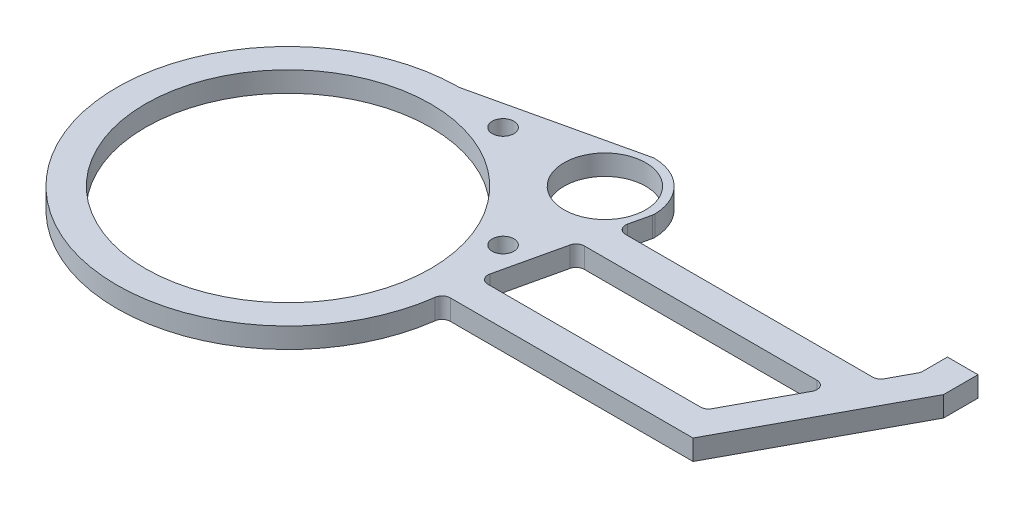
ISO-10303-21;
HEADER;
FILE_DESCRIPTION(('STEP AP214'),'2;1');
FILE_NAME('part.step','',(''),(''),'','','');
FILE_SCHEMA(('AUTOMOTIVE_DESIGN { 1 0 10303 214 1 1 1 1 }'));
ENDSEC;
DATA;
#1=APPLICATION_CONTEXT('core data for automotive mechanical design processes');
#2=APPLICATION_PROTOCOL_DEFINITION('international standard','automotive_design',2000,#1);
#3=PRODUCT_CONTEXT('',#1,'mechanical');
#4=PRODUCT('Part','Part','',(#3));
#5=PRODUCT_RELATED_PRODUCT_CATEGORY('part','',(#4));
#6=PRODUCT_DEFINITION_FORMATION('','',#4);
#7=PRODUCT_DEFINITION_CONTEXT('part definition',#1,'design');
#8=PRODUCT_DEFINITION('design','',#6,#7);
#9=PRODUCT_DEFINITION_SHAPE('','',#8);
#10=(LENGTH_UNIT() NAMED_UNIT(*) SI_UNIT(.MILLI.,.METRE.));
#11=(NAMED_UNIT(*) PLANE_ANGLE_UNIT() SI_UNIT($,.RADIAN.));
#12=(NAMED_UNIT(*) SI_UNIT($,.STERADIAN.) SOLID_ANGLE_UNIT());
#13=UNCERTAINTY_MEASURE_WITH_UNIT(LENGTH_MEASURE(1.E-05),#10,'distance_accuracy_value','');
#14=(GEOMETRIC_REPRESENTATION_CONTEXT(3) GLOBAL_UNCERTAINTY_ASSIGNED_CONTEXT((#13)) GLOBAL_UNIT_ASSIGNED_CONTEXT((#10,
#11,#12)) REPRESENTATION_CONTEXT('',''));
#15=CARTESIAN_POINT('',(0.,0.,0.));
#16=DIRECTION('',(0.,0.,1.));
#17=DIRECTION('',(1.,0.,0.));
#18=AXIS2_PLACEMENT_3D('',#15,#16,#17);
#19=CARTESIAN_POINT('',(53.3781,6.35,0.));
#20=DIRECTION('',(-0.974850171968633,0.,-0.222861262252387));
#21=DIRECTION('',(-0.222861262252387,0.,0.974850171968633));
#22=AXIS2_PLACEMENT_3D('',#19,#20,#21);
#23=PLANE('',#22);
#24=DIRECTION('',(0.222861262252387,0.,-0.974850171968633));
#25=VECTOR('',#24,1.);
#26=CARTESIAN_POINT('',(53.3781,0.,0.));
#27=LINE('',#26,#25);
#28=CARTESIAN_POINT('',(55.1581234537427,0.,-7.78626196608432));
#29=VERTEX_POINT('',#28);
#30=CARTESIAN_POINT('',(59.8034945878766,0.,-28.1062619660843));
#31=VERTEX_POINT('',#30);
#32=EDGE_CURVE('E320',#29,#31,#27,.T.);
#33=ORIENTED_EDGE('',*,*,#32,.T.);
#34=DIRECTION('',(0.,1.,0.));
#35=VECTOR('',#34,1.);
#36=CARTESIAN_POINT('',(59.8034945878766,6.35,-28.1062619660843));
#37=LINE('',#36,#35);
#38=CARTESIAN_POINT('',(59.8034945878766,6.35,-28.1062619660843));
#39=VERTEX_POINT('',#38);
#40=EDGE_CURVE('E371',#31,#39,#37,.T.);
#41=ORIENTED_EDGE('',*,*,#40,.T.);
#42=DIRECTION('',(0.222861262252387,0.,-0.974850171968633));
#43=VECTOR('',#42,1.);
#44=CARTESIAN_POINT('',(53.3781,6.35,0.));
#45=LINE('',#44,#43);
#46=CARTESIAN_POINT('',(55.1581234537427,6.35,-7.78626196608432));
#47=VERTEX_POINT('',#46);
#48=EDGE_CURVE('E308',#47,#39,#45,.T.);
#49=ORIENTED_EDGE('',*,*,#48,.F.);
#50=DIRECTION('',(0.,-1.,0.));
#51=VECTOR('',#50,1.);
#52=CARTESIAN_POINT('',(55.1581234537427,6.35,-7.78626196608431));
#53=LINE('',#52,#51);
#54=EDGE_CURVE('E368',#47,#29,#53,.T.);
#55=ORIENTED_EDGE('',*,*,#54,.T.);
#56=EDGE_LOOP('',(#33,#41,#49,#55));
#57=FACE_BOUND('',#56,.T.);
#58=ADVANCED_FACE('F35',(#57),#23,.F.);
#59=CARTESIAN_POINT('',(0.,6.35,0.));
#60=DIRECTION('',(0.,-1.,0.));
#61=DIRECTION('',(0.,0.,-1.));
#62=AXIS2_PLACEMENT_3D('',#59,#60,#61);
#63=CYLINDRICAL_SURFACE('',#62,53.3781);
#64=CARTESIAN_POINT('',(0.,0.,0.));
#65=DIRECTION('',(0.,1.,0.));
#66=DIRECTION('',(0.,0.,1.));
#67=AXIS2_PLACEMENT_3D('',#64,#65,#66);
#68=CIRCLE('',#67,53.3781);
#69=CARTESIAN_POINT('',(-0.658160349786323,0.,-53.3740422355659));
#70=VERTEX_POINT('',#69);
#71=CARTESIAN_POINT('',(52.9105666564598,0.,7.04936136840211));
#72=VERTEX_POINT('',#71);
#73=EDGE_CURVE('E297',#70,#72,#68,.T.);
#74=ORIENTED_EDGE('',*,*,#73,.T.);
#75=DIRECTION('',(0.,-1.,0.));
#76=VECTOR('',#75,1.);
#77=CARTESIAN_POINT('',(52.9105666564598,6.35,7.0493613684021));
#78=LINE('',#77,#76);
#79=CARTESIAN_POINT('',(52.9105666564598,6.35,7.04936136840211));
#80=VERTEX_POINT('',#79);
#81=EDGE_CURVE('E390',#72,#80,#78,.F.);
#82=ORIENTED_EDGE('',*,*,#81,.T.);
#83=CARTESIAN_POINT('',(0.,6.35,0.));
#84=DIRECTION('',(0.,1.,0.));
#85=DIRECTION('',(0.,0.,1.));
#86=AXIS2_PLACEMENT_3D('',#83,#84,#85);
#87=CIRCLE('',#86,53.3781);
#88=CARTESIAN_POINT('',(-0.658160349786323,6.35,-53.3740422355659));
#89=VERTEX_POINT('',#88);
#90=EDGE_CURVE('E304',#89,#80,#87,.T.);
#91=ORIENTED_EDGE('',*,*,#90,.F.);
#92=DIRECTION('',(0.,-1.,0.));
#93=VECTOR('',#92,1.);
#94=CARTESIAN_POINT('',(-0.658160349786323,6.35,-53.3740422355659));
#95=LINE('',#94,#93);
#96=EDGE_CURVE('E316',#89,#70,#95,.T.);
#97=ORIENTED_EDGE('',*,*,#96,.T.);
#98=EDGE_LOOP('',(#74,#82,#91,#97));
#99=FACE_BOUND('',#98,.T.);
#100=ADVANCED_FACE('F469',(#99),#63,.T.);
#101=CARTESIAN_POINT('',(63.1423550905353,6.35,-42.7112619660843));
#102=VERTEX_POINT('',#101);
#103=CARTESIAN_POINT('',(64.602685842109,6.35,-49.0991091402179));
#104=VERTEX_POINT('',#103);
#105=EDGE_CURVE('E306',#102,#104,#45,.T.);
#106=ORIENTED_EDGE('',*,*,#105,.F.);
#107=DIRECTION('',(0.,-1.,0.));
#108=VECTOR('',#107,1.);
#109=CARTESIAN_POINT('',(63.1423550905353,6.35,-42.7112619660843));
#110=LINE('',#109,#108);
#111=CARTESIAN_POINT('',(63.1423550905353,0.,-42.7112619660843));
#112=VERTEX_POINT('',#111);
#113=EDGE_CURVE('E339',#102,#112,#110,.T.);
#114=ORIENTED_EDGE('',*,*,#113,.T.);
#115=CARTESIAN_POINT('',(64.602685842109,0.,-49.0991091402179));
#116=VERTEX_POINT('',#115);
#117=EDGE_CURVE('E319',#112,#116,#27,.T.);
#118=ORIENTED_EDGE('',*,*,#117,.T.);
#119=DIRECTION('',(0.,-1.,0.));
#120=VECTOR('',#119,1.);
#121=CARTESIAN_POINT('',(64.602685842109,6.35,-49.0991091402179));
#122=LINE('',#121,#120);
#123=EDGE_CURVE('E337',#116,#104,#122,.F.);
#124=ORIENTED_EDGE('',*,*,#123,.T.);
#125=EDGE_LOOP('',(#106,#114,#118,#124));
#126=FACE_BOUND('',#125,.T.);
#127=ADVANCED_FACE('F471',(#126),#23,.F.);
#128=CARTESIAN_POINT('',(49.3914086658803,6.35,-49.3914086658803));
#129=DIRECTION('',(0.,-1.,0.));
#130=DIRECTION('',(0.,0.,-1.));
#131=AXIS2_PLACEMENT_3D('',#128,#129,#130);
#132=CYLINDRICAL_SURFACE('',#131,15.2781);
#133=CARTESIAN_POINT('',(49.3914086658803,0.,-49.3914086658803));
#134=DIRECTION('',(0.,1.,0.));
#135=DIRECTION('',(0.,0.,-1.));
#136=AXIS2_PLACEMENT_3D('',#133,#134,#135);
#137=CIRCLE('',#136,15.2781);
#138=CARTESIAN_POINT('',(64.6659797132705,0.,-49.7197665928911));
#139=VERTEX_POINT('',#138);
#140=CARTESIAN_POINT('',(49.7197665928911,0.,-64.6659797132705));
#141=VERTEX_POINT('',#140);
#142=EDGE_CURVE('E323',#139,#141,#137,.T.);
#143=ORIENTED_EDGE('',*,*,#142,.T.);
#144=DIRECTION('',(0.,-1.,0.));
#145=VECTOR('',#144,1.);
#146=CARTESIAN_POINT('',(49.7197665928911,6.35,-64.6659797132705));
#147=LINE('',#146,#145);
#148=CARTESIAN_POINT('',(49.7197665928911,6.35,-64.6659797132705));
#149=VERTEX_POINT('',#148);
#150=EDGE_CURVE('E384',#141,#149,#147,.F.);
#151=ORIENTED_EDGE('',*,*,#150,.T.);
#152=CARTESIAN_POINT('',(49.3914086658803,6.35,-49.3914086658803));
#153=DIRECTION('',(0.,1.,0.));
#154=DIRECTION('',(0.,0.,-1.));
#155=AXIS2_PLACEMENT_3D('',#152,#153,#154);
#156=CIRCLE('',#155,15.2781);
#157=CARTESIAN_POINT('',(64.6659797132705,6.35,-49.7197665928911));
#158=VERTEX_POINT('',#157);
#159=EDGE_CURVE('E311',#158,#149,#156,.T.);
#160=ORIENTED_EDGE('',*,*,#159,.F.);
#161=DIRECTION('',(0.,-1.,0.));
#162=VECTOR('',#161,1.);
#163=CARTESIAN_POINT('',(64.6659797132705,6.35,-49.7197665928911));
#164=LINE('',#163,#162);
#165=EDGE_CURVE('E381',#158,#139,#164,.T.);
#166=ORIENTED_EDGE('',*,*,#165,.T.);
#167=EDGE_LOOP('',(#143,#151,#160,#166));
#168=FACE_BOUND('',#167,.T.);
#169=ADVANCED_FACE('F479',(#168),#132,.T.);
#170=CARTESIAN_POINT('',(0.,6.35,-53.3781));
#171=DIRECTION('',(0.222861262252387,0.,0.974850171968633));
#172=DIRECTION('',(0.974850171968633,0.,-0.222861262252387));
#173=AXIS2_PLACEMENT_3D('',#170,#171,#172);
#174=PLANE('',#173);
#175=DIRECTION('',(-0.974850171968633,0.,0.222861262252387));
#176=VECTOR('',#175,1.);
#177=CARTESIAN_POINT('',(0.,6.35,-53.3781));
#178=LINE('',#177,#176);
#179=CARTESIAN_POINT('',(49.0991091402179,6.35,-64.602685842109));
#180=VERTEX_POINT('',#179);
#181=CARTESIAN_POINT('',(0.678712168991673,6.35,-53.5332609211722));
#182=VERTEX_POINT('',#181);
#183=EDGE_CURVE('E314',#180,#182,#178,.T.);
#184=ORIENTED_EDGE('',*,*,#183,.F.);
#185=DIRECTION('',(0.,-1.,0.));
#186=VECTOR('',#185,1.);
#187=CARTESIAN_POINT('',(49.0991091402179,6.35,-64.602685842109));
#188=LINE('',#187,#186);
#189=CARTESIAN_POINT('',(49.0991091402179,0.,-64.602685842109));
#190=VERTEX_POINT('',#189);
#191=EDGE_CURVE('E374',#180,#190,#188,.T.);
#192=ORIENTED_EDGE('',*,*,#191,.T.);
#193=DIRECTION('',(-0.974850171968633,0.,0.222861262252387));
#194=VECTOR('',#193,1.);
#195=CARTESIAN_POINT('',(0.,0.,-53.3781));
#196=LINE('',#195,#194);
#197=CARTESIAN_POINT('',(0.678712168991673,0.,-53.5332609211722));
#198=VERTEX_POINT('',#197);
#199=EDGE_CURVE('E307',#190,#198,#196,.T.);
#200=ORIENTED_EDGE('',*,*,#199,.T.);
#201=DIRECTION('',(0.,1.,0.));
#202=VECTOR('',#201,1.);
#203=CARTESIAN_POINT('',(0.678712168991673,6.35,-53.5332609211722));
#204=LINE('',#203,#202);
#205=EDGE_CURVE('E329',#198,#182,#204,.T.);
#206=ORIENTED_EDGE('',*,*,#205,.T.);
#207=EDGE_LOOP('',(#184,#192,#200,#206));
#208=FACE_BOUND('',#207,.T.);
#209=ADVANCED_FACE('F484',(#208),#174,.F.);
#210=CARTESIAN_POINT('',(0.,6.35,0.));
#211=DIRECTION('',(0.,1.,0.));
#212=DIRECTION('',(0.,0.,1.));
#213=AXIS2_PLACEMENT_3D('',#210,#211,#212);
#214=PLANE('',#213);
#215=CARTESIAN_POINT('',(49.3914086658803,6.35,-17.6414086658803));
#216=DIRECTION('',(0.,1.,0.));
#217=DIRECTION('',(0.,0.,1.));
#218=AXIS2_PLACEMENT_3D('',#215,#216,#217);
#219=CIRCLE('',#218,3.37819999999999);
#220=CARTESIAN_POINT('',(49.3914086658803,6.35,-14.2632086658804));
#221=VERTEX_POINT('',#220);
#222=EDGE_CURVE('E831',#221,#221,#219,.T.);
#223=ORIENTED_EDGE('',*,*,#222,.F.);
#224=EDGE_LOOP('',(#223));
#225=FACE_BOUND('',#224,.T.);
#226=CARTESIAN_POINT('',(17.6414086658803,6.35,-49.3914086658804));
#227=DIRECTION('',(0.,1.,0.));
#228=DIRECTION('',(0.,0.,1.));
#229=AXIS2_PLACEMENT_3D('',#226,#227,#228);
#230=CIRCLE('',#229,3.3782);
#231=CARTESIAN_POINT('',(17.6414086658803,6.35,-46.0132086658804));
#232=VERTEX_POINT('',#231);
#233=EDGE_CURVE('E841',#232,#232,#230,.T.);
#234=ORIENTED_EDGE('',*,*,#233,.F.);
#235=EDGE_LOOP('',(#234));
#236=FACE_BOUND('',#235,.T.);
#237=CARTESIAN_POINT('',(49.3914086658803,6.35,-49.3914086658803));
#238=DIRECTION('',(0.,1.,0.));
#239=DIRECTION('',(0.,0.,1.));
#240=AXIS2_PLACEMENT_3D('',#237,#238,#239);
#241=CIRCLE('',#240,12.7254);
#242=CARTESIAN_POINT('',(49.3914086658803,6.35,-36.6660086658803));
#243=VERTEX_POINT('',#242);
#244=EDGE_CURVE('E217',#243,#243,#241,.T.);
#245=ORIENTED_EDGE('',*,*,#244,.F.);
#246=EDGE_LOOP('',(#245));
#247=FACE_BOUND('',#246,.T.);
#248=CARTESIAN_POINT('',(0.,6.35,0.));
#249=DIRECTION('',(0.,1.,0.));
#250=DIRECTION('',(0.,0.,1.));
#251=AXIS2_PLACEMENT_3D('',#248,#249,#250);
#252=CIRCLE('',#251,44.4754);
#253=CARTESIAN_POINT('',(0.,6.35,44.4754));
#254=VERTEX_POINT('',#253);
#255=EDGE_CURVE('E229',#254,#254,#252,.T.);
#256=ORIENTED_EDGE('',*,*,#255,.F.);
#257=EDGE_LOOP('',(#256));
#258=FACE_BOUND('',#257,.T.);
#259=ORIENTED_EDGE('',*,*,#159,.T.);
#260=CARTESIAN_POINT('',(49.665176746339,6.35,-62.1265664053087));
#261=DIRECTION('',(0.,1.,0.));
#262=DIRECTION('',(0.,0.,1.));
#263=AXIS2_PLACEMENT_3D('',#260,#261,#262);
#264=CIRCLE('',#263,2.54);
#265=EDGE_CURVE('E388',#149,#180,#264,.T.);
#266=ORIENTED_EDGE('',*,*,#265,.T.);
#267=ORIENTED_EDGE('',*,*,#183,.T.);
#268=CARTESIAN_POINT('',(-0.736456846310987,6.35,-59.723559513173));
#269=DIRECTION('',(0.,1.,0.));
#270=DIRECTION('',(0.,0.,1.));
#271=AXIS2_PLACEMENT_3D('',#268,#269,#270);
#272=CIRCLE('',#271,6.35);
#273=EDGE_CURVE('E335',#182,#89,#272,.F.);
#274=ORIENTED_EDGE('',*,*,#273,.T.);
#275=ORIENTED_EDGE('',*,*,#90,.T.);
#276=CARTESIAN_POINT('',(55.4283190550542,6.35,7.38480564003675));
#277=DIRECTION('',(0.,1.,0.));
#278=DIRECTION('',(0.,0.,1.));
#279=AXIS2_PLACEMENT_3D('',#276,#277,#278);
#280=CIRCLE('',#279,2.54);
#281=CARTESIAN_POINT('',(55.4283190550542,6.35,4.84480564003675));
#282=VERTEX_POINT('',#281);
#283=EDGE_CURVE('E50',#80,#282,#280,.F.);
#284=ORIENTED_EDGE('',*,*,#283,.T.);
#285=DIRECTION('',(1.,0.,0.));
#286=VECTOR('',#285,1.);
#287=CARTESIAN_POINT('',(52.07,6.35,4.84480564003675));
#288=LINE('',#287,#286);
#289=CARTESIAN_POINT('',(131.116478856658,6.35,4.84480564003675));
#290=VERTEX_POINT('',#289);
#291=EDGE_CURVE('E234',#282,#290,#288,.T.);
#292=ORIENTED_EDGE('',*,*,#291,.T.);
#293=DIRECTION('',(0.473591355647654,0.,-0.880744700725367));
#294=VECTOR('',#293,1.);
#295=CARTESIAN_POINT('',(131.116478856658,6.35,4.84480564003675));
#296=LINE('',#295,#294);
#297=CARTESIAN_POINT('',(158.4325,6.35,-45.9551943599632));
#298=VERTEX_POINT('',#297);
#299=EDGE_CURVE('E269',#290,#298,#296,.T.);
#300=ORIENTED_EDGE('',*,*,#299,.T.);
#301=DIRECTION('',(0.,0.,-1.));
#302=VECTOR('',#301,1.);
#303=CARTESIAN_POINT('',(158.4325,6.35,-45.9551943599632));
#304=LINE('',#303,#302);
#305=CARTESIAN_POINT('',(158.4325,6.35,-56.6794420996495));
#306=VERTEX_POINT('',#305);
#307=EDGE_CURVE('E272',#298,#306,#304,.T.);
#308=ORIENTED_EDGE('',*,*,#307,.T.);
#309=DIRECTION('',(-1.,0.,0.));
#310=VECTOR('',#309,1.);
#311=CARTESIAN_POINT('',(158.4325,6.35,-56.6794420996495));
#312=LINE('',#311,#310);
#313=CARTESIAN_POINT('',(148.9075,6.35,-56.6794420996495));
#314=VERTEX_POINT('',#313);
#315=EDGE_CURVE('E275',#306,#314,#312,.T.);
#316=ORIENTED_EDGE('',*,*,#315,.T.);
#317=DIRECTION('',(0.,0.,1.));
#318=VECTOR('',#317,1.);
#319=CARTESIAN_POINT('',(148.9075,6.35,-48.3536898393359));
#320=LINE('',#319,#318);
#321=CARTESIAN_POINT('',(148.9075,6.35,-48.9932886338353));
#322=VERTEX_POINT('',#321);
#323=EDGE_CURVE('E278',#314,#322,#320,.T.);
#324=ORIENTED_EDGE('',*,*,#323,.T.);
#325=CARTESIAN_POINT('',(146.3675,6.35,-48.9932886338353));
#326=DIRECTION('',(0.,1.,0.));
#327=DIRECTION('',(0.,0.,1.));
#328=AXIS2_PLACEMENT_3D('',#325,#326,#327);
#329=CIRCLE('',#328,2.54);
#330=CARTESIAN_POINT('',(148.604591539842,6.35,-47.7903665904903));
#331=VERTEX_POINT('',#330);
#332=EDGE_CURVE('E402',#322,#331,#329,.F.);
#333=ORIENTED_EDGE('',*,*,#332,.T.);
#334=DIRECTION('',(-0.473591355647655,0.,0.880744700725367));
#335=VECTOR('',#334,1.);
#336=CARTESIAN_POINT('',(144.20328567939,6.35,-39.6051943599632));
#337=LINE('',#336,#335);
#338=CARTESIAN_POINT('',(144.922255162349,6.35,-40.9422723166182));
#339=VERTEX_POINT('',#338);
#340=EDGE_CURVE('E281',#331,#339,#337,.T.);
#341=ORIENTED_EDGE('',*,*,#340,.T.);
#342=CARTESIAN_POINT('',(142.685163622506,6.35,-42.1451943599632));
#343=DIRECTION('',(0.,1.,0.));
#344=DIRECTION('',(0.,0.,1.));
#345=AXIS2_PLACEMENT_3D('',#342,#343,#344);
#346=CIRCLE('',#345,2.54);
#347=CARTESIAN_POINT('',(142.685163622506,6.35,-39.6051943599632));
#348=VERTEX_POINT('',#347);
#349=EDGE_CURVE('E398',#339,#348,#346,.F.);
#350=ORIENTED_EDGE('',*,*,#349,.T.);
#351=DIRECTION('',(-1.,0.,0.));
#352=VECTOR('',#351,1.);
#353=CARTESIAN_POINT('',(52.07,6.35,-39.6051943599632));
#354=LINE('',#353,#352);
#355=CARTESIAN_POINT('',(65.6184745273356,6.35,-39.6051943599632));
#356=VERTEX_POINT('',#355);
#357=EDGE_CURVE('E284',#348,#356,#354,.T.);
#358=ORIENTED_EDGE('',*,*,#357,.T.);
#359=CARTESIAN_POINT('',(65.6184745273356,6.35,-42.1451943599632));
#360=DIRECTION('',(0.,1.,0.));
#361=DIRECTION('',(0.,0.,1.));
#362=AXIS2_PLACEMENT_3D('',#359,#360,#361);
#363=CIRCLE('',#362,2.54);
#364=EDGE_CURVE('E396',#356,#102,#363,.F.);
#365=ORIENTED_EDGE('',*,*,#364,.T.);
#366=ORIENTED_EDGE('',*,*,#105,.T.);
#367=CARTESIAN_POINT('',(62.1265664053087,6.35,-49.665176746339));
#368=DIRECTION('',(0.,1.,0.));
#369=DIRECTION('',(0.,0.,1.));
#370=AXIS2_PLACEMENT_3D('',#367,#368,#369);
#371=CIRCLE('',#370,2.54);
#372=EDGE_CURVE('E386',#104,#158,#371,.T.);
#373=ORIENTED_EDGE('',*,*,#372,.T.);
#374=EDGE_LOOP('',(#259,#266,#267,#274,#275,#284,#292,#300,#308,#316,#324,#333,#341,#350,#358,
#365,#366,#373));
#375=FACE_BOUND('',#374,.T.);
#376=DIRECTION('',(-1.,0.,0.));
#377=VECTOR('',#376,1.);
#378=CARTESIAN_POINT('',(52.07,6.35,-4.68019435996325));
#379=LINE('',#378,#377);
#380=CARTESIAN_POINT('',(123.905399086458,6.35,-4.68019435996325));
#381=VERTEX_POINT('',#380);
#382=CARTESIAN_POINT('',(57.6342428905431,6.35,-4.68019435996325));
#383=VERTEX_POINT('',#382);
#384=EDGE_CURVE('E240',#381,#383,#379,.T.);
#385=ORIENTED_EDGE('',*,*,#384,.T.);
#386=CARTESIAN_POINT('',(57.6342428905431,6.35,-7.22019435996325));
#387=DIRECTION('',(0.,1.,0.));
#388=DIRECTION('',(0.,0.,1.));
#389=AXIS2_PLACEMENT_3D('',#386,#387,#388);
#390=CIRCLE('',#389,2.54);
#391=EDGE_CURVE('E11',#383,#47,#390,.F.);
#392=ORIENTED_EDGE('',*,*,#391,.T.);
#393=ORIENTED_EDGE('',*,*,#48,.T.);
#394=CARTESIAN_POINT('',(62.2796140246769,6.35,-27.5401943599632));
#395=DIRECTION('',(0.,1.,0.));
#396=DIRECTION('',(0.,0.,1.));
#397=AXIS2_PLACEMENT_3D('',#394,#395,#396);
#398=CIRCLE('',#397,2.54);
#399=CARTESIAN_POINT('',(62.2796140246769,6.35,-30.0801943599632));
#400=VERTEX_POINT('',#399);
#401=EDGE_CURVE('E414',#39,#400,#398,.F.);
#402=ORIENTED_EDGE('',*,*,#401,.T.);
#403=DIRECTION('',(1.,0.,0.));
#404=VECTOR('',#403,1.);
#405=CARTESIAN_POINT('',(52.07,6.35,-30.0801943599632));
#406=LINE('',#405,#404);
#407=CARTESIAN_POINT('',(134.831807543795,6.35,-30.0801943599632));
#408=VERTEX_POINT('',#407);
#409=EDGE_CURVE('E287',#400,#408,#406,.T.);
#410=ORIENTED_EDGE('',*,*,#409,.T.);
#411=CARTESIAN_POINT('',(134.831807543795,6.35,-27.5401943599632));
#412=DIRECTION('',(0.,1.,0.));
#413=DIRECTION('',(0.,0.,1.));
#414=AXIS2_PLACEMENT_3D('',#411,#412,#413);
#415=CIRCLE('',#414,2.54);
#416=CARTESIAN_POINT('',(137.068899083638,6.35,-26.3372723166182));
#417=VERTEX_POINT('',#416);
#418=EDGE_CURVE('E406',#408,#417,#415,.F.);
#419=ORIENTED_EDGE('',*,*,#418,.T.);
#420=DIRECTION('',(-0.473591355647654,0.,0.880744700725367));
#421=VECTOR('',#420,1.);
#422=CARTESIAN_POINT('',(125.423521143342,6.35,-4.68019435996325));
#423=LINE('',#422,#421);
#424=CARTESIAN_POINT('',(126.142490626301,6.35,-6.01727231661821));
#425=VERTEX_POINT('',#424);
#426=EDGE_CURVE('E290',#417,#425,#423,.T.);
#427=ORIENTED_EDGE('',*,*,#426,.T.);
#428=CARTESIAN_POINT('',(123.905399086458,6.35,-7.22019435996325));
#429=DIRECTION('',(0.,1.,0.));
#430=DIRECTION('',(0.,0.,1.));
#431=AXIS2_PLACEMENT_3D('',#428,#429,#430);
#432=CIRCLE('',#431,2.54);
#433=EDGE_CURVE('E410',#425,#381,#432,.F.);
#434=ORIENTED_EDGE('',*,*,#433,.T.);
#435=EDGE_LOOP('',(#385,#392,#393,#402,#410,#419,#427,#434));
#436=FACE_BOUND('',#435,.T.);
#437=ADVANCED_FACE('F436',(#225,#236,#247,#258,#375,#436),#214,.T.);
#438=CARTESIAN_POINT('',(0.,0.,0.));
#439=DIRECTION('',(0.,1.,0.));
#440=DIRECTION('',(0.,0.,1.));
#441=AXIS2_PLACEMENT_3D('',#438,#439,#440);
#442=PLANE('',#441);
#443=CARTESIAN_POINT('',(49.3914086658803,0.,-17.6414086658803));
#444=DIRECTION('',(0.,-1.,0.));
#445=DIRECTION('',(0.,0.,-1.));
#446=AXIS2_PLACEMENT_3D('',#443,#444,#445);
#447=CIRCLE('',#446,3.3782);
#448=CARTESIAN_POINT('',(49.3914086658803,0.,-21.0196086658803));
#449=VERTEX_POINT('',#448);
#450=EDGE_CURVE('E834',#449,#449,#447,.T.);
#451=ORIENTED_EDGE('',*,*,#450,.F.);
#452=EDGE_LOOP('',(#451));
#453=FACE_BOUND('',#452,.T.);
#454=CARTESIAN_POINT('',(17.6414086658803,0.,-49.3914086658804));
#455=DIRECTION('',(0.,-1.,0.));
#456=DIRECTION('',(0.,0.,-1.));
#457=AXIS2_PLACEMENT_3D('',#454,#455,#456);
#458=CIRCLE('',#457,3.3782);
#459=CARTESIAN_POINT('',(17.6414086658803,0.,-52.7696086658804));
#460=VERTEX_POINT('',#459);
#461=EDGE_CURVE('E836',#460,#460,#458,.T.);
#462=ORIENTED_EDGE('',*,*,#461,.F.);
#463=EDGE_LOOP('',(#462));
#464=FACE_BOUND('',#463,.T.);
#465=CARTESIAN_POINT('',(49.3914086658803,0.,-49.3914086658803));
#466=DIRECTION('',(0.,1.,0.));
#467=DIRECTION('',(0.,0.,1.));
#468=AXIS2_PLACEMENT_3D('',#465,#466,#467);
#469=CIRCLE('',#468,12.7254);
#470=CARTESIAN_POINT('',(49.3914086658803,0.,-36.6660086658803));
#471=VERTEX_POINT('',#470);
#472=EDGE_CURVE('E221',#471,#471,#469,.T.);
#473=ORIENTED_EDGE('',*,*,#472,.T.);
#474=EDGE_LOOP('',(#473));
#475=FACE_BOUND('',#474,.T.);
#476=CARTESIAN_POINT('',(0.,0.,0.));
#477=DIRECTION('',(0.,1.,0.));
#478=DIRECTION('',(0.,0.,1.));
#479=AXIS2_PLACEMENT_3D('',#476,#477,#478);
#480=CIRCLE('',#479,44.4754);
#481=CARTESIAN_POINT('',(0.,0.,44.4754));
#482=VERTEX_POINT('',#481);
#483=EDGE_CURVE('E231',#482,#482,#480,.T.);
#484=ORIENTED_EDGE('',*,*,#483,.T.);
#485=EDGE_LOOP('',(#484));
#486=FACE_BOUND('',#485,.T.);
#487=ORIENTED_EDGE('',*,*,#199,.F.);
#488=CARTESIAN_POINT('',(49.665176746339,0.,-62.1265664053087));
#489=DIRECTION('',(0.,1.,0.));
#490=DIRECTION('',(0.,0.,1.));
#491=AXIS2_PLACEMENT_3D('',#488,#489,#490);
#492=CIRCLE('',#491,2.54);
#493=EDGE_CURVE('E379',#190,#141,#492,.F.);
#494=ORIENTED_EDGE('',*,*,#493,.T.);
#495=ORIENTED_EDGE('',*,*,#142,.F.);
#496=CARTESIAN_POINT('',(62.1265664053087,0.,-49.665176746339));
#497=DIRECTION('',(0.,1.,0.));
#498=DIRECTION('',(0.,0.,1.));
#499=AXIS2_PLACEMENT_3D('',#496,#497,#498);
#500=CIRCLE('',#499,2.54);
#501=EDGE_CURVE('E377',#139,#116,#500,.F.);
#502=ORIENTED_EDGE('',*,*,#501,.T.);
#503=ORIENTED_EDGE('',*,*,#117,.F.);
#504=CARTESIAN_POINT('',(65.6184745273356,0.,-42.1451943599632));
#505=DIRECTION('',(0.,1.,0.));
#506=DIRECTION('',(0.,0.,1.));
#507=AXIS2_PLACEMENT_3D('',#504,#505,#506);
#508=CIRCLE('',#507,2.54);
#509=CARTESIAN_POINT('',(65.6184745273356,0.,-39.6051943599632));
#510=VERTEX_POINT('',#509);
#511=EDGE_CURVE('E394',#112,#510,#508,.T.);
#512=ORIENTED_EDGE('',*,*,#511,.T.);
#513=DIRECTION('',(-1.,0.,0.));
#514=VECTOR('',#513,1.);
#515=CARTESIAN_POINT('',(52.07,0.,-39.6051943599632));
#516=LINE('',#515,#514);
#517=CARTESIAN_POINT('',(142.685163622506,0.,-39.6051943599632));
#518=VERTEX_POINT('',#517);
#519=EDGE_CURVE('E255',#518,#510,#516,.T.);
#520=ORIENTED_EDGE('',*,*,#519,.F.);
#521=CARTESIAN_POINT('',(142.685163622506,0.,-42.1451943599632));
#522=DIRECTION('',(0.,1.,0.));
#523=DIRECTION('',(0.,0.,1.));
#524=AXIS2_PLACEMENT_3D('',#521,#522,#523);
#525=CIRCLE('',#524,2.54);
#526=CARTESIAN_POINT('',(144.922255162349,0.,-40.9422723166182));
#527=VERTEX_POINT('',#526);
#528=EDGE_CURVE('E400',#518,#527,#525,.T.);
#529=ORIENTED_EDGE('',*,*,#528,.T.);
#530=DIRECTION('',(-0.473591355647655,0.,0.880744700725367));
#531=VECTOR('',#530,1.);
#532=CARTESIAN_POINT('',(144.20328567939,0.,-39.6051943599632));
#533=LINE('',#532,#531);
#534=CARTESIAN_POINT('',(148.604591539842,0.,-47.7903665904903));
#535=VERTEX_POINT('',#534);
#536=EDGE_CURVE('E252',#535,#527,#533,.T.);
#537=ORIENTED_EDGE('',*,*,#536,.F.);
#538=CARTESIAN_POINT('',(146.3675,0.,-48.9932886338353));
#539=DIRECTION('',(0.,1.,0.));
#540=DIRECTION('',(0.,0.,1.));
#541=AXIS2_PLACEMENT_3D('',#538,#539,#540);
#542=CIRCLE('',#541,2.54);
#543=CARTESIAN_POINT('',(148.9075,0.,-48.9932886338353));
#544=VERTEX_POINT('',#543);
#545=EDGE_CURVE('E404',#535,#544,#542,.T.);
#546=ORIENTED_EDGE('',*,*,#545,.T.);
#547=DIRECTION('',(0.,0.,1.));
#548=VECTOR('',#547,1.);
#549=CARTESIAN_POINT('',(148.9075,0.,-48.3536898393359));
#550=LINE('',#549,#548);
#551=CARTESIAN_POINT('',(148.9075,0.,-56.6794420996495));
#552=VERTEX_POINT('',#551);
#553=EDGE_CURVE('E249',#552,#544,#550,.T.);
#554=ORIENTED_EDGE('',*,*,#553,.F.);
#555=DIRECTION('',(-1.,0.,0.));
#556=VECTOR('',#555,1.);
#557=CARTESIAN_POINT('',(158.4325,0.,-56.6794420996495));
#558=LINE('',#557,#556);
#559=CARTESIAN_POINT('',(158.4325,0.,-56.6794420996495));
#560=VERTEX_POINT('',#559);
#561=EDGE_CURVE('E246',#560,#552,#558,.T.);
#562=ORIENTED_EDGE('',*,*,#561,.F.);
#563=DIRECTION('',(0.,0.,-1.));
#564=VECTOR('',#563,1.);
#565=CARTESIAN_POINT('',(158.4325,0.,-45.9551943599632));
#566=LINE('',#565,#564);
#567=CARTESIAN_POINT('',(158.4325,0.,-45.9551943599632));
#568=VERTEX_POINT('',#567);
#569=EDGE_CURVE('E243',#568,#560,#566,.T.);
#570=ORIENTED_EDGE('',*,*,#569,.F.);
#571=DIRECTION('',(0.473591355647654,0.,-0.880744700725367));
#572=VECTOR('',#571,1.);
#573=CARTESIAN_POINT('',(131.116478856658,0.,4.84480564003675));
#574=LINE('',#573,#572);
#575=CARTESIAN_POINT('',(131.116478856658,0.,4.84480564003675));
#576=VERTEX_POINT('',#575);
#577=EDGE_CURVE('E239',#576,#568,#574,.T.);
#578=ORIENTED_EDGE('',*,*,#577,.F.);
#579=DIRECTION('',(1.,0.,0.));
#580=VECTOR('',#579,1.);
#581=CARTESIAN_POINT('',(52.07,0.,4.84480564003675));
#582=LINE('',#581,#580);
#583=CARTESIAN_POINT('',(55.4283190550542,0.,4.84480564003675));
#584=VERTEX_POINT('',#583);
#585=EDGE_CURVE('E237',#584,#576,#582,.T.);
#586=ORIENTED_EDGE('',*,*,#585,.F.);
#587=CARTESIAN_POINT('',(55.4283190550542,0.,7.38480564003675));
#588=DIRECTION('',(0.,1.,0.));
#589=DIRECTION('',(0.,0.,1.));
#590=AXIS2_PLACEMENT_3D('',#587,#588,#589);
#591=CIRCLE('',#590,2.54);
#592=EDGE_CURVE('E419',#584,#72,#591,.T.);
#593=ORIENTED_EDGE('',*,*,#592,.T.);
#594=ORIENTED_EDGE('',*,*,#73,.F.);
#595=CARTESIAN_POINT('',(-0.736456846310987,0.,-59.723559513173));
#596=DIRECTION('',(0.,1.,0.));
#597=DIRECTION('',(0.,0.,1.));
#598=AXIS2_PLACEMENT_3D('',#595,#596,#597);
#599=CIRCLE('',#598,6.35);
#600=EDGE_CURVE('E332',#70,#198,#599,.T.);
#601=ORIENTED_EDGE('',*,*,#600,.T.);
#602=EDGE_LOOP('',(#487,#494,#495,#502,#503,#512,#520,#529,#537,#546,#554,#562,#570,#578,#586,
#593,#594,#601));
#603=FACE_BOUND('',#602,.T.);
#604=DIRECTION('',(1.,0.,0.));
#605=VECTOR('',#604,1.);
#606=CARTESIAN_POINT('',(52.07,0.,-30.0801943599632));
#607=LINE('',#606,#605);
#608=CARTESIAN_POINT('',(62.2796140246769,0.,-30.0801943599632));
#609=VERTEX_POINT('',#608);
#610=CARTESIAN_POINT('',(134.831807543795,0.,-30.0801943599632));
#611=VERTEX_POINT('',#610);
#612=EDGE_CURVE('E258',#609,#611,#607,.T.);
#613=ORIENTED_EDGE('',*,*,#612,.F.);
#614=CARTESIAN_POINT('',(62.2796140246769,0.,-27.5401943599632));
#615=DIRECTION('',(0.,1.,0.));
#616=DIRECTION('',(0.,0.,1.));
#617=AXIS2_PLACEMENT_3D('',#614,#615,#616);
#618=CIRCLE('',#617,2.54);
#619=EDGE_CURVE('E416',#609,#31,#618,.T.);
#620=ORIENTED_EDGE('',*,*,#619,.T.);
#621=ORIENTED_EDGE('',*,*,#32,.F.);
#622=CARTESIAN_POINT('',(57.6342428905431,0.,-7.22019435996325));
#623=DIRECTION('',(0.,1.,0.));
#624=DIRECTION('',(0.,0.,1.));
#625=AXIS2_PLACEMENT_3D('',#622,#623,#624);
#626=CIRCLE('',#625,2.54);
#627=CARTESIAN_POINT('',(57.6342428905431,0.,-4.68019435996325));
#628=VERTEX_POINT('',#627);
#629=EDGE_CURVE('E43',#29,#628,#626,.T.);
#630=ORIENTED_EDGE('',*,*,#629,.T.);
#631=DIRECTION('',(-1.,0.,0.));
#632=VECTOR('',#631,1.);
#633=CARTESIAN_POINT('',(52.07,0.,-4.68019435996325));
#634=LINE('',#633,#632);
#635=CARTESIAN_POINT('',(123.905399086458,0.,-4.68019435996325));
#636=VERTEX_POINT('',#635);
#637=EDGE_CURVE('E264',#636,#628,#634,.T.);
#638=ORIENTED_EDGE('',*,*,#637,.F.);
#639=CARTESIAN_POINT('',(123.905399086458,0.,-7.22019435996325));
#640=DIRECTION('',(0.,1.,0.));
#641=DIRECTION('',(0.,0.,1.));
#642=AXIS2_PLACEMENT_3D('',#639,#640,#641);
#643=CIRCLE('',#642,2.54);
#644=CARTESIAN_POINT('',(126.142490626301,0.,-6.01727231661821));
#645=VERTEX_POINT('',#644);
#646=EDGE_CURVE('E412',#636,#645,#643,.T.);
#647=ORIENTED_EDGE('',*,*,#646,.T.);
#648=DIRECTION('',(-0.473591355647654,0.,0.880744700725367));
#649=VECTOR('',#648,1.);
#650=CARTESIAN_POINT('',(125.423521143342,0.,-4.68019435996325));
#651=LINE('',#650,#649);
#652=CARTESIAN_POINT('',(137.068899083638,0.,-26.3372723166182));
#653=VERTEX_POINT('',#652);
#654=EDGE_CURVE('E261',#653,#645,#651,.T.);
#655=ORIENTED_EDGE('',*,*,#654,.F.);
#656=CARTESIAN_POINT('',(134.831807543795,0.,-27.5401943599632));
#657=DIRECTION('',(0.,1.,0.));
#658=DIRECTION('',(0.,0.,1.));
#659=AXIS2_PLACEMENT_3D('',#656,#657,#658);
#660=CIRCLE('',#659,2.54);
#661=EDGE_CURVE('E408',#653,#611,#660,.T.);
#662=ORIENTED_EDGE('',*,*,#661,.T.);
#663=EDGE_LOOP('',(#613,#620,#621,#630,#638,#647,#655,#662));
#664=FACE_BOUND('',#663,.T.);
#665=ADVANCED_FACE('F424',(#453,#464,#475,#486,#603,#664),#442,.F.);
#666=CARTESIAN_POINT('',(-0.736456846310987,6.35,-59.723559513173));
#667=DIRECTION('',(0.,-1.,0.));
#668=DIRECTION('',(0.,0.,-1.));
#669=AXIS2_PLACEMENT_3D('',#666,#667,#668);
#670=CYLINDRICAL_SURFACE('',#669,6.35);
#671=ORIENTED_EDGE('',*,*,#273,.F.);
#672=ORIENTED_EDGE('',*,*,#205,.F.);
#673=ORIENTED_EDGE('',*,*,#600,.F.);
#674=ORIENTED_EDGE('',*,*,#96,.F.);
#675=EDGE_LOOP('',(#671,#672,#673,#674));
#676=FACE_BOUND('',#675,.T.);
#677=ADVANCED_FACE('F544',(#676),#670,.F.);
#678=CARTESIAN_POINT('',(52.07,0.,-4.68019435996325));
#679=DIRECTION('',(0.,0.,-1.));
#680=DIRECTION('',(-1.,0.,0.));
#681=AXIS2_PLACEMENT_3D('',#678,#679,#680);
#682=PLANE('',#681);
#683=ORIENTED_EDGE('',*,*,#384,.F.);
#684=DIRECTION('',(0.,1.,0.));
#685=VECTOR('',#684,1.);
#686=CARTESIAN_POINT('',(123.905399086458,0.,-4.68019435996325));
#687=LINE('',#686,#685);
#688=EDGE_CURVE('E366',#381,#636,#687,.F.);
#689=ORIENTED_EDGE('',*,*,#688,.T.);
#690=ORIENTED_EDGE('',*,*,#637,.T.);
#691=DIRECTION('',(0.,-1.,0.));
#692=VECTOR('',#691,1.);
#693=CARTESIAN_POINT('',(57.6342428905431,0.,-4.68019435996325));
#694=LINE('',#693,#692);
#695=EDGE_CURVE('E364',#628,#383,#694,.F.);
#696=ORIENTED_EDGE('',*,*,#695,.T.);
#697=EDGE_LOOP('',(#683,#689,#690,#696));
#698=FACE_BOUND('',#697,.T.);
#699=ADVANCED_FACE('F431',(#698),#682,.T.);
#700=CARTESIAN_POINT('',(52.07,0.,-30.0801943599632));
#701=DIRECTION('',(0.,0.,1.));
#702=DIRECTION('',(1.,0.,0.));
#703=AXIS2_PLACEMENT_3D('',#700,#701,#702);
#704=PLANE('',#703);
#705=ORIENTED_EDGE('',*,*,#612,.T.);
#706=DIRECTION('',(0.,1.,0.));
#707=VECTOR('',#706,1.);
#708=CARTESIAN_POINT('',(134.831807543795,6.35,-30.0801943599632));
#709=LINE('',#708,#707);
#710=EDGE_CURVE('E356',#611,#408,#709,.T.);
#711=ORIENTED_EDGE('',*,*,#710,.T.);
#712=ORIENTED_EDGE('',*,*,#409,.F.);
#713=DIRECTION('',(0.,1.,0.));
#714=VECTOR('',#713,1.);
#715=CARTESIAN_POINT('',(62.2796140246769,0.,-30.0801943599632));
#716=LINE('',#715,#714);
#717=EDGE_CURVE('E354',#400,#609,#716,.F.);
#718=ORIENTED_EDGE('',*,*,#717,.T.);
#719=EDGE_LOOP('',(#705,#711,#712,#718));
#720=FACE_BOUND('',#719,.T.);
#721=ADVANCED_FACE('F445',(#720),#704,.T.);
#722=CARTESIAN_POINT('',(52.07,0.,-39.6051943599632));
#723=DIRECTION('',(0.,0.,-1.));
#724=DIRECTION('',(-1.,0.,0.));
#725=AXIS2_PLACEMENT_3D('',#722,#723,#724);
#726=PLANE('',#725);
#727=ORIENTED_EDGE('',*,*,#519,.T.);
#728=DIRECTION('',(0.,-1.,0.));
#729=VECTOR('',#728,1.);
#730=CARTESIAN_POINT('',(65.6184745273356,0.,-39.6051943599632));
#731=LINE('',#730,#729);
#732=EDGE_CURVE('E344',#510,#356,#731,.F.);
#733=ORIENTED_EDGE('',*,*,#732,.T.);
#734=ORIENTED_EDGE('',*,*,#357,.F.);
#735=DIRECTION('',(0.,1.,0.));
#736=VECTOR('',#735,1.);
#737=CARTESIAN_POINT('',(142.685163622506,0.,-39.6051943599632));
#738=LINE('',#737,#736);
#739=EDGE_CURVE('E342',#348,#518,#738,.F.);
#740=ORIENTED_EDGE('',*,*,#739,.T.);
#741=EDGE_LOOP('',(#727,#733,#734,#740));
#742=FACE_BOUND('',#741,.T.);
#743=ADVANCED_FACE('F502',(#742),#726,.T.);
#744=CARTESIAN_POINT('',(52.07,0.,4.84480564003675));
#745=DIRECTION('',(0.,0.,1.));
#746=DIRECTION('',(1.,0.,0.));
#747=AXIS2_PLACEMENT_3D('',#744,#745,#746);
#748=PLANE('',#747);
#749=ORIENTED_EDGE('',*,*,#291,.F.);
#750=DIRECTION('',(0.,-1.,0.));
#751=VECTOR('',#750,1.);
#752=CARTESIAN_POINT('',(55.4283190550542,0.,4.84480564003675));
#753=LINE('',#752,#751);
#754=EDGE_CURVE('E392',#282,#584,#753,.T.);
#755=ORIENTED_EDGE('',*,*,#754,.T.);
#756=ORIENTED_EDGE('',*,*,#585,.T.);
#757=DIRECTION('',(0.,1.,0.));
#758=VECTOR('',#757,1.);
#759=CARTESIAN_POINT('',(131.116478856658,0.,4.84480564003675));
#760=LINE('',#759,#758);
#761=EDGE_CURVE('E267',#576,#290,#760,.T.);
#762=ORIENTED_EDGE('',*,*,#761,.T.);
#763=EDGE_LOOP('',(#749,#755,#756,#762));
#764=FACE_BOUND('',#763,.T.);
#765=ADVANCED_FACE('F632',(#764),#748,.T.);
#766=CARTESIAN_POINT('',(125.423521143342,0.,-4.68019435996325));
#767=DIRECTION('',(-0.880744700725367,0.,-0.473591355647654));
#768=DIRECTION('',(-0.473591355647654,0.,0.880744700725367));
#769=AXIS2_PLACEMENT_3D('',#766,#767,#768);
#770=PLANE('',#769);
#771=ORIENTED_EDGE('',*,*,#426,.F.);
#772=DIRECTION('',(0.,1.,0.));
#773=VECTOR('',#772,1.);
#774=CARTESIAN_POINT('',(137.068899083638,0.,-26.3372723166182));
#775=LINE('',#774,#773);
#776=EDGE_CURVE('E362',#417,#653,#775,.F.);
#777=ORIENTED_EDGE('',*,*,#776,.T.);
#778=ORIENTED_EDGE('',*,*,#654,.T.);
#779=DIRECTION('',(0.,1.,0.));
#780=VECTOR('',#779,1.);
#781=CARTESIAN_POINT('',(126.142490626301,6.35,-6.01727231661821));
#782=LINE('',#781,#780);
#783=EDGE_CURVE('E359',#645,#425,#782,.T.);
#784=ORIENTED_EDGE('',*,*,#783,.T.);
#785=EDGE_LOOP('',(#771,#777,#778,#784));
#786=FACE_BOUND('',#785,.T.);
#787=ADVANCED_FACE('F453',(#786),#770,.T.);
#788=CARTESIAN_POINT('',(144.20328567939,0.,-39.6051943599632));
#789=DIRECTION('',(-0.880744700725367,0.,-0.473591355647655));
#790=DIRECTION('',(-0.473591355647655,0.,0.880744700725367));
#791=AXIS2_PLACEMENT_3D('',#788,#789,#790);
#792=PLANE('',#791);
#793=ORIENTED_EDGE('',*,*,#536,.T.);
#794=DIRECTION('',(0.,1.,0.));
#795=VECTOR('',#794,1.);
#796=CARTESIAN_POINT('',(144.922255162349,6.35,-40.9422723166182));
#797=LINE('',#796,#795);
#798=EDGE_CURVE('E348',#527,#339,#797,.T.);
#799=ORIENTED_EDGE('',*,*,#798,.T.);
#800=ORIENTED_EDGE('',*,*,#340,.F.);
#801=DIRECTION('',(0.,1.,0.));
#802=VECTOR('',#801,1.);
#803=CARTESIAN_POINT('',(148.604591539842,0.,-47.7903665904903));
#804=LINE('',#803,#802);
#805=EDGE_CURVE('E346',#331,#535,#804,.F.);
#806=ORIENTED_EDGE('',*,*,#805,.T.);
#807=EDGE_LOOP('',(#793,#799,#800,#806));
#808=FACE_BOUND('',#807,.T.);
#809=ADVANCED_FACE('F511',(#808),#792,.T.);
#810=CARTESIAN_POINT('',(148.9075,0.,-48.3536898393359));
#811=DIRECTION('',(-1.,0.,0.));
#812=DIRECTION('',(0.,0.,1.));
#813=AXIS2_PLACEMENT_3D('',#810,#811,#812);
#814=PLANE('',#813);
#815=ORIENTED_EDGE('',*,*,#553,.T.);
#816=DIRECTION('',(0.,1.,0.));
#817=VECTOR('',#816,1.);
#818=CARTESIAN_POINT('',(148.9075,6.35,-48.9932886338353));
#819=LINE('',#818,#817);
#820=EDGE_CURVE('E351',#544,#322,#819,.T.);
#821=ORIENTED_EDGE('',*,*,#820,.T.);
#822=ORIENTED_EDGE('',*,*,#323,.F.);
#823=DIRECTION('',(0.,1.,0.));
#824=VECTOR('',#823,1.);
#825=CARTESIAN_POINT('',(148.9075,0.,-56.6794420996495));
#826=LINE('',#825,#824);
#827=EDGE_CURVE('E295',#552,#314,#826,.T.);
#828=ORIENTED_EDGE('',*,*,#827,.F.);
#829=EDGE_LOOP('',(#815,#821,#822,#828));
#830=FACE_BOUND('',#829,.T.);
#831=ADVANCED_FACE('F519',(#830),#814,.T.);
#832=CARTESIAN_POINT('',(158.4325,0.,-56.6794420996495));
#833=DIRECTION('',(0.,0.,-1.));
#834=DIRECTION('',(-1.,0.,0.));
#835=AXIS2_PLACEMENT_3D('',#832,#833,#834);
#836=PLANE('',#835);
#837=CARTESIAN_POINT('',(153.67,3.175,-56.6794420996497));
#838=DIRECTION('',(0.,0.,-1.));
#839=DIRECTION('',(-1.,0.,0.));
#840=AXIS2_PLACEMENT_3D('',#837,#838,#839);
#841=CIRCLE('',#840,1.7526000000001);
#842=CARTESIAN_POINT('',(151.9174,3.175,-56.6794420996497));
#843=VERTEX_POINT('',#842);
#844=EDGE_CURVE('E844',#843,#843,#841,.T.);
#845=ORIENTED_EDGE('',*,*,#844,.F.);
#846=EDGE_LOOP('',(#845));
#847=FACE_BOUND('',#846,.T.);
#848=ORIENTED_EDGE('',*,*,#315,.F.);
#849=DIRECTION('',(0.,1.,0.));
#850=VECTOR('',#849,1.);
#851=CARTESIAN_POINT('',(158.4325,0.,-56.6794420996495));
#852=LINE('',#851,#850);
#853=EDGE_CURVE('E298',#560,#306,#852,.T.);
#854=ORIENTED_EDGE('',*,*,#853,.F.);
#855=ORIENTED_EDGE('',*,*,#561,.T.);
#856=ORIENTED_EDGE('',*,*,#827,.T.);
#857=EDGE_LOOP('',(#848,#854,#855,#856));
#858=FACE_BOUND('',#857,.T.);
#859=ADVANCED_FACE('F523',(#847,#858),#836,.T.);
#860=CARTESIAN_POINT('',(158.4325,0.,-45.9551943599632));
#861=DIRECTION('',(1.,0.,0.));
#862=DIRECTION('',(0.,0.,-1.));
#863=AXIS2_PLACEMENT_3D('',#860,#861,#862);
#864=PLANE('',#863);
#865=ORIENTED_EDGE('',*,*,#307,.F.);
#866=DIRECTION('',(0.,1.,0.));
#867=VECTOR('',#866,1.);
#868=CARTESIAN_POINT('',(158.4325,0.,-45.9551943599632));
#869=LINE('',#868,#867);
#870=EDGE_CURVE('E300',#568,#298,#869,.T.);
#871=ORIENTED_EDGE('',*,*,#870,.F.);
#872=ORIENTED_EDGE('',*,*,#569,.T.);
#873=ORIENTED_EDGE('',*,*,#853,.T.);
#874=EDGE_LOOP('',(#865,#871,#872,#873));
#875=FACE_BOUND('',#874,.T.);
#876=ADVANCED_FACE('F528',(#875),#864,.T.);
#877=CARTESIAN_POINT('',(131.116478856658,0.,4.84480564003675));
#878=DIRECTION('',(0.880744700725367,0.,0.473591355647654));
#879=DIRECTION('',(0.473591355647654,0.,-0.880744700725368));
#880=AXIS2_PLACEMENT_3D('',#877,#878,#879);
#881=PLANE('',#880);
#882=ORIENTED_EDGE('',*,*,#299,.F.);
#883=ORIENTED_EDGE('',*,*,#761,.F.);
#884=ORIENTED_EDGE('',*,*,#577,.T.);
#885=ORIENTED_EDGE('',*,*,#870,.T.);
#886=EDGE_LOOP('',(#882,#883,#884,#885));
#887=FACE_BOUND('',#886,.T.);
#888=ADVANCED_FACE('F531',(#887),#881,.T.);
#889=CARTESIAN_POINT('',(0.,0.,0.));
#890=DIRECTION('',(0.,1.,0.));
#891=DIRECTION('',(0.,0.,1.));
#892=AXIS2_PLACEMENT_3D('',#889,#890,#891);
#893=CYLINDRICAL_SURFACE('',#892,44.4754);
#894=ORIENTED_EDGE('',*,*,#483,.F.);
#895=EDGE_LOOP('',(#894));
#896=FACE_BOUND('',#895,.T.);
#897=ORIENTED_EDGE('',*,*,#255,.T.);
#898=EDGE_LOOP('',(#897));
#899=FACE_BOUND('',#898,.T.);
#900=ADVANCED_FACE('F705',(#896,#899),#893,.F.);
#901=CARTESIAN_POINT('',(49.3914086658803,0.,-49.3914086658803));
#902=DIRECTION('',(0.,1.,0.));
#903=DIRECTION('',(0.,0.,1.));
#904=AXIS2_PLACEMENT_3D('',#901,#902,#903);
#905=CYLINDRICAL_SURFACE('',#904,12.7254);
#906=ORIENTED_EDGE('',*,*,#472,.F.);
#907=EDGE_LOOP('',(#906));
#908=FACE_BOUND('',#907,.T.);
#909=ORIENTED_EDGE('',*,*,#244,.T.);
#910=EDGE_LOOP('',(#909));
#911=FACE_BOUND('',#910,.T.);
#912=ADVANCED_FACE('F603',(#908,#911),#905,.F.);
#913=CARTESIAN_POINT('',(65.6184745273356,6.35,-42.1451943599632));
#914=DIRECTION('',(0.,-1.,0.));
#915=DIRECTION('',(0.,0.,-1.));
#916=AXIS2_PLACEMENT_3D('',#913,#914,#915);
#917=CYLINDRICAL_SURFACE('',#916,2.54);
#918=ORIENTED_EDGE('',*,*,#364,.F.);
#919=ORIENTED_EDGE('',*,*,#732,.F.);
#920=ORIENTED_EDGE('',*,*,#511,.F.);
#921=ORIENTED_EDGE('',*,*,#113,.F.);
#922=EDGE_LOOP('',(#918,#919,#920,#921));
#923=FACE_BOUND('',#922,.T.);
#924=ADVANCED_FACE('F495',(#923),#917,.F.);
#925=CARTESIAN_POINT('',(142.685163622506,0.,-42.1451943599632));
#926=DIRECTION('',(0.,-1.,0.));
#927=DIRECTION('',(0.,0.,-1.));
#928=AXIS2_PLACEMENT_3D('',#925,#926,#927);
#929=CYLINDRICAL_SURFACE('',#928,2.54);
#930=ORIENTED_EDGE('',*,*,#528,.F.);
#931=ORIENTED_EDGE('',*,*,#739,.F.);
#932=ORIENTED_EDGE('',*,*,#349,.F.);
#933=ORIENTED_EDGE('',*,*,#798,.F.);
#934=EDGE_LOOP('',(#930,#931,#932,#933));
#935=FACE_BOUND('',#934,.T.);
#936=ADVANCED_FACE('F506',(#935),#929,.F.);
#937=CARTESIAN_POINT('',(146.3675,0.,-48.9932886338353));
#938=DIRECTION('',(0.,-1.,0.));
#939=DIRECTION('',(0.,0.,-1.));
#940=AXIS2_PLACEMENT_3D('',#937,#938,#939);
#941=CYLINDRICAL_SURFACE('',#940,2.54);
#942=ORIENTED_EDGE('',*,*,#545,.F.);
#943=ORIENTED_EDGE('',*,*,#805,.F.);
#944=ORIENTED_EDGE('',*,*,#332,.F.);
#945=ORIENTED_EDGE('',*,*,#820,.F.);
#946=EDGE_LOOP('',(#942,#943,#944,#945));
#947=FACE_BOUND('',#946,.T.);
#948=ADVANCED_FACE('F466',(#947),#941,.F.);
#949=CARTESIAN_POINT('',(134.831807543795,0.,-27.5401943599632));
#950=DIRECTION('',(0.,-1.,0.));
#951=DIRECTION('',(0.,0.,-1.));
#952=AXIS2_PLACEMENT_3D('',#949,#950,#951);
#953=CYLINDRICAL_SURFACE('',#952,2.54);
#954=ORIENTED_EDGE('',*,*,#661,.F.);
#955=ORIENTED_EDGE('',*,*,#776,.F.);
#956=ORIENTED_EDGE('',*,*,#418,.F.);
#957=ORIENTED_EDGE('',*,*,#710,.F.);
#958=EDGE_LOOP('',(#954,#955,#956,#957));
#959=FACE_BOUND('',#958,.T.);
#960=ADVANCED_FACE('F449',(#959),#953,.F.);
#961=CARTESIAN_POINT('',(123.905399086458,0.,-7.22019435996325));
#962=DIRECTION('',(0.,-1.,0.));
#963=DIRECTION('',(0.,0.,-1.));
#964=AXIS2_PLACEMENT_3D('',#961,#962,#963);
#965=CYLINDRICAL_SURFACE('',#964,2.54);
#966=ORIENTED_EDGE('',*,*,#646,.F.);
#967=ORIENTED_EDGE('',*,*,#688,.F.);
#968=ORIENTED_EDGE('',*,*,#433,.F.);
#969=ORIENTED_EDGE('',*,*,#783,.F.);
#970=EDGE_LOOP('',(#966,#967,#968,#969));
#971=FACE_BOUND('',#970,.T.);
#972=ADVANCED_FACE('F457',(#971),#965,.F.);
#973=CARTESIAN_POINT('',(62.2796140246769,6.35,-27.5401943599632));
#974=DIRECTION('',(0.,1.,0.));
#975=DIRECTION('',(0.,0.,1.));
#976=AXIS2_PLACEMENT_3D('',#973,#974,#975);
#977=CYLINDRICAL_SURFACE('',#976,2.54);
#978=ORIENTED_EDGE('',*,*,#619,.F.);
#979=ORIENTED_EDGE('',*,*,#717,.F.);
#980=ORIENTED_EDGE('',*,*,#401,.F.);
#981=ORIENTED_EDGE('',*,*,#40,.F.);
#982=EDGE_LOOP('',(#978,#979,#980,#981));
#983=FACE_BOUND('',#982,.T.);
#984=ADVANCED_FACE('F441',(#983),#977,.F.);
#985=CARTESIAN_POINT('',(49.665176746339,6.35,-62.1265664053087));
#986=DIRECTION('',(0.,-1.,0.));
#987=DIRECTION('',(0.,0.,-1.));
#988=AXIS2_PLACEMENT_3D('',#985,#986,#987);
#989=CYLINDRICAL_SURFACE('',#988,2.54);
#990=ORIENTED_EDGE('',*,*,#265,.F.);
#991=ORIENTED_EDGE('',*,*,#150,.F.);
#992=ORIENTED_EDGE('',*,*,#493,.F.);
#993=ORIENTED_EDGE('',*,*,#191,.F.);
#994=EDGE_LOOP('',(#990,#991,#992,#993));
#995=FACE_BOUND('',#994,.T.);
#996=ADVANCED_FACE('F464',(#995),#989,.T.);
#997=CARTESIAN_POINT('',(62.1265664053087,6.35,-49.665176746339));
#998=DIRECTION('',(0.,-1.,0.));
#999=DIRECTION('',(0.,0.,-1.));
#1000=AXIS2_PLACEMENT_3D('',#997,#998,#999);
#1001=CYLINDRICAL_SURFACE('',#1000,2.54);
#1002=ORIENTED_EDGE('',*,*,#372,.F.);
#1003=ORIENTED_EDGE('',*,*,#123,.F.);
#1004=ORIENTED_EDGE('',*,*,#501,.F.);
#1005=ORIENTED_EDGE('',*,*,#165,.F.);
#1006=EDGE_LOOP('',(#1002,#1003,#1004,#1005));
#1007=FACE_BOUND('',#1006,.T.);
#1008=ADVANCED_FACE('F554',(#1007),#1001,.T.);
#1009=CARTESIAN_POINT('',(55.4283190550542,6.35,7.38480564003675));
#1010=DIRECTION('',(0.,-1.,0.));
#1011=DIRECTION('',(0.,0.,-1.));
#1012=AXIS2_PLACEMENT_3D('',#1009,#1010,#1011);
#1013=CYLINDRICAL_SURFACE('',#1012,2.54);
#1014=ORIENTED_EDGE('',*,*,#592,.F.);
#1015=ORIENTED_EDGE('',*,*,#754,.F.);
#1016=ORIENTED_EDGE('',*,*,#283,.F.);
#1017=ORIENTED_EDGE('',*,*,#81,.F.);
#1018=EDGE_LOOP('',(#1014,#1015,#1016,#1017));
#1019=FACE_BOUND('',#1018,.T.);
#1020=ADVANCED_FACE('F537',(#1019),#1013,.F.);
#1021=CARTESIAN_POINT('',(57.6342428905431,6.35,-7.22019435996325));
#1022=DIRECTION('',(0.,-1.,0.));
#1023=DIRECTION('',(0.,0.,-1.));
#1024=AXIS2_PLACEMENT_3D('',#1021,#1022,#1023);
#1025=CYLINDRICAL_SURFACE('',#1024,2.54);
#1026=ORIENTED_EDGE('',*,*,#391,.F.);
#1027=ORIENTED_EDGE('',*,*,#695,.F.);
#1028=ORIENTED_EDGE('',*,*,#629,.F.);
#1029=ORIENTED_EDGE('',*,*,#54,.F.);
#1030=EDGE_LOOP('',(#1026,#1027,#1028,#1029));
#1031=FACE_BOUND('',#1030,.T.);
#1032=ADVANCED_FACE('F37',(#1031),#1025,.F.);
#1033=CARTESIAN_POINT('',(153.67,3.175,-47.2814420996496));
#1034=DIRECTION('',(0.,0.,-1.));
#1035=DIRECTION('',(-1.,0.,0.));
#1036=AXIS2_PLACEMENT_3D('',#1033,#1034,#1035);
#1037=CONICAL_SURFACE('',#1036,1.35255000000001,1.02974425867665);
#1038=CARTESIAN_POINT('',(153.67,3.175,-46.4687480693838));
#1039=VERTEX_POINT('',#1038);
#1040=VERTEX_LOOP('',#1039);
#1041=FACE_BOUND('',#1040,.T.);
#1042=CARTESIAN_POINT('',(153.67,3.175,-47.2814420996496));
#1043=DIRECTION('',(0.,0.,-1.));
#1044=DIRECTION('',(-1.,0.,0.));
#1045=AXIS2_PLACEMENT_3D('',#1042,#1043,#1044);
#1046=CIRCLE('',#1045,1.35255000000001);
#1047=CARTESIAN_POINT('',(152.31745,3.175,-47.2814420996496));
#1048=VERTEX_POINT('',#1047);
#1049=EDGE_CURVE('E215',#1048,#1048,#1046,.T.);
#1050=ORIENTED_EDGE('',*,*,#1049,.T.);
#1051=EDGE_LOOP('',(#1050));
#1052=FACE_BOUND('',#1051,.T.);
#1053=ADVANCED_FACE('F208',(#1041,#1052),#1037,.F.);
#1054=CARTESIAN_POINT('',(153.67,3.175,-56.6794420996495));
#1055=DIRECTION('',(0.,0.,-1.));
#1056=DIRECTION('',(-1.,0.,0.));
#1057=AXIS2_PLACEMENT_3D('',#1054,#1055,#1056);
#1058=CYLINDRICAL_SURFACE('',#1057,1.35255000000001);
#1059=ORIENTED_EDGE('',*,*,#1049,.F.);
#1060=EDGE_LOOP('',(#1059));
#1061=FACE_BOUND('',#1060,.T.);
#1062=CARTESIAN_POINT('',(153.67,3.175,-49.5674420996495));
#1063=DIRECTION('',(0.,0.,-1.));
#1064=DIRECTION('',(-1.,0.,0.));
#1065=AXIS2_PLACEMENT_3D('',#1062,#1063,#1064);
#1066=CIRCLE('',#1065,1.35255000000001);
#1067=CARTESIAN_POINT('',(152.31745,3.175,-49.5674420996495));
#1068=VERTEX_POINT('',#1067);
#1069=EDGE_CURVE('E218',#1068,#1068,#1066,.T.);
#1070=ORIENTED_EDGE('',*,*,#1069,.T.);
#1071=EDGE_LOOP('',(#1070));
#1072=FACE_BOUND('',#1071,.T.);
#1073=ADVANCED_FACE('F211',(#1061,#1072),#1058,.F.);
#1074=CARTESIAN_POINT('',(155.02255,3.175,-49.5674420996495));
#1075=DIRECTION('',(0.,0.,1.));
#1076=DIRECTION('',(1.,0.,0.));
#1077=AXIS2_PLACEMENT_3D('',#1074,#1075,#1076);
#1078=PLANE('',#1077);
#1079=ORIENTED_EDGE('',*,*,#1069,.F.);
#1080=EDGE_LOOP('',(#1079));
#1081=FACE_BOUND('',#1080,.T.);
#1082=CARTESIAN_POINT('',(153.67,3.175,-49.5674420996495));
#1083=DIRECTION('',(0.,0.,-1.));
#1084=DIRECTION('',(-1.,0.,0.));
#1085=AXIS2_PLACEMENT_3D('',#1082,#1083,#1084);
#1086=CIRCLE('',#1085,1.75259999999999);
#1087=CARTESIAN_POINT('',(151.9174,3.175,-49.5674420996495));
#1088=VERTEX_POINT('',#1087);
#1089=EDGE_CURVE('E224',#1088,#1088,#1086,.T.);
#1090=ORIENTED_EDGE('',*,*,#1089,.T.);
#1091=EDGE_LOOP('',(#1090));
#1092=FACE_BOUND('',#1091,.T.);
#1093=ADVANCED_FACE('F763',(#1081,#1092),#1078,.F.);
#1094=CARTESIAN_POINT('',(153.67,3.175,-56.6794420996495));
#1095=DIRECTION('',(0.,0.,-1.));
#1096=DIRECTION('',(-1.,0.,0.));
#1097=AXIS2_PLACEMENT_3D('',#1094,#1095,#1096);
#1098=CYLINDRICAL_SURFACE('',#1097,1.75260000000005);
#1099=ORIENTED_EDGE('',*,*,#1089,.F.);
#1100=EDGE_LOOP('',(#1099));
#1101=FACE_BOUND('',#1100,.T.);
#1102=ORIENTED_EDGE('',*,*,#844,.T.);
#1103=EDGE_LOOP('',(#1102));
#1104=FACE_BOUND('',#1103,.T.);
#1105=ADVANCED_FACE('F757',(#1101,#1104),#1098,.F.);
#1106=CARTESIAN_POINT('',(17.6414086658803,0.,-49.3914086658804));
#1107=DIRECTION('',(0.,-1.,0.));
#1108=DIRECTION('',(0.,0.,-1.));
#1109=AXIS2_PLACEMENT_3D('',#1106,#1107,#1108);
#1110=CYLINDRICAL_SURFACE('',#1109,3.3782);
#1111=ORIENTED_EDGE('',*,*,#233,.T.);
#1112=EDGE_LOOP('',(#1111));
#1113=FACE_BOUND('',#1112,.T.);
#1114=ORIENTED_EDGE('',*,*,#461,.T.);
#1115=EDGE_LOOP('',(#1114));
#1116=FACE_BOUND('',#1115,.T.);
#1117=ADVANCED_FACE('F762',(#1113,#1116),#1110,.F.);
#1118=CARTESIAN_POINT('',(49.3914086658803,0.,-17.6414086658803));
#1119=DIRECTION('',(0.,-1.,0.));
#1120=DIRECTION('',(0.,0.,-1.));
#1121=AXIS2_PLACEMENT_3D('',#1118,#1119,#1120);
#1122=CYLINDRICAL_SURFACE('',#1121,3.37819999999999);
#1123=ORIENTED_EDGE('',*,*,#222,.T.);
#1124=EDGE_LOOP('',(#1123));
#1125=FACE_BOUND('',#1124,.T.);
#1126=ORIENTED_EDGE('',*,*,#450,.T.);
#1127=EDGE_LOOP('',(#1126));
#1128=FACE_BOUND('',#1127,.T.);
#1129=ADVANCED_FACE('F822',(#1125,#1128),#1122,.F.);
#1130=CLOSED_SHELL('',(#58,#100,#127,#169,#209,#437,#665,#677,#699,#721,#743,#765,#787,#809,
#831,#859,#876,#888,#900,#912,#924,#936,#948,#960,#972,#984,#996,#1008,#1020,#1032,#1053,#1073,
#1093,#1105,#1117,#1129));
#1131=MANIFOLD_SOLID_BREP('B2',#1130);
#1132=ADVANCED_BREP_SHAPE_REPRESENTATION('',(#18,#1131),#14);
#1133=SHAPE_DEFINITION_REPRESENTATION(#9,#1132);
ENDSEC;
END-ISO-10303-21;
